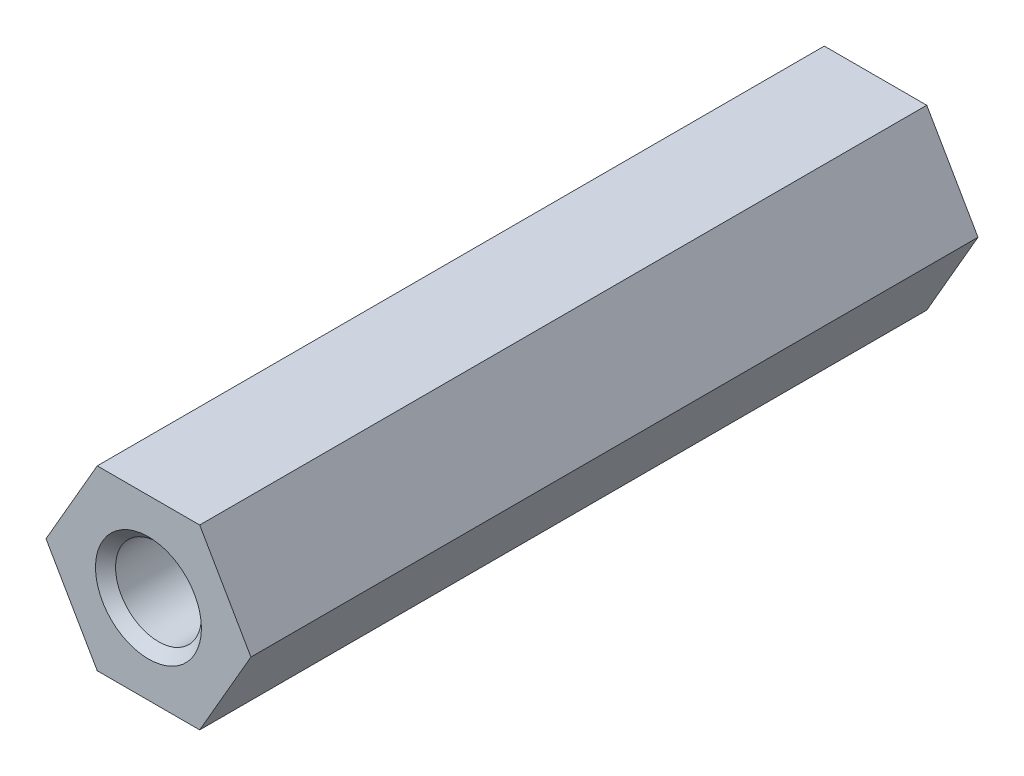
ISO-10303-21;
HEADER;
FILE_DESCRIPTION(('STEP AP214'),'2;1');
FILE_NAME('part.step','',(''),(''),'','','');
FILE_SCHEMA(('AUTOMOTIVE_DESIGN { 1 0 10303 214 1 1 1 1 }'));
ENDSEC;
DATA;
#1=APPLICATION_CONTEXT('core data for automotive mechanical design processes');
#2=APPLICATION_PROTOCOL_DEFINITION('international standard','automotive_design',2000,#1);
#3=PRODUCT_CONTEXT('',#1,'mechanical');
#4=PRODUCT('Part','Part','',(#3));
#5=PRODUCT_RELATED_PRODUCT_CATEGORY('part','',(#4));
#6=PRODUCT_DEFINITION_FORMATION('','',#4);
#7=PRODUCT_DEFINITION_CONTEXT('part definition',#1,'design');
#8=PRODUCT_DEFINITION('design','',#6,#7);
#9=PRODUCT_DEFINITION_SHAPE('','',#8);
#10=(LENGTH_UNIT() NAMED_UNIT(*) SI_UNIT(.MILLI.,.METRE.));
#11=(NAMED_UNIT(*) PLANE_ANGLE_UNIT() SI_UNIT($,.RADIAN.));
#12=(NAMED_UNIT(*) SI_UNIT($,.STERADIAN.) SOLID_ANGLE_UNIT());
#13=UNCERTAINTY_MEASURE_WITH_UNIT(LENGTH_MEASURE(1.E-05),#10,'distance_accuracy_value','');
#14=(GEOMETRIC_REPRESENTATION_CONTEXT(3) GLOBAL_UNCERTAINTY_ASSIGNED_CONTEXT((#13)) GLOBAL_UNIT_ASSIGNED_CONTEXT((#10,
#11,#12)) REPRESENTATION_CONTEXT('',''));
#15=CARTESIAN_POINT('',(0.,0.,0.));
#16=DIRECTION('',(0.,0.,1.));
#17=DIRECTION('',(1.,0.,0.));
#18=AXIS2_PLACEMENT_3D('',#15,#16,#17);
#19=CARTESIAN_POINT('',(-1.78978583448784,-3.1,0.));
#20=DIRECTION('',(0.,-1.,0.));
#21=DIRECTION('',(0.,0.,-1.));
#22=AXIS2_PLACEMENT_3D('',#19,#20,#21);
#23=PLANE('',#22);
#24=DIRECTION('',(0.,0.,1.));
#25=VECTOR('',#24,1.);
#26=CARTESIAN_POINT('',(-1.78978583448784,-3.1,0.));
#27=LINE('',#26,#25);
#28=CARTESIAN_POINT('',(-1.78978583448784,-3.1,0.));
#29=VERTEX_POINT('',#28);
#30=CARTESIAN_POINT('',(-1.78978583448784,-3.1,25.4));
#31=VERTEX_POINT('',#30);
#32=EDGE_CURVE('E100',#29,#31,#27,.T.);
#33=ORIENTED_EDGE('',*,*,#32,.F.);
#34=DIRECTION('',(1.,0.,0.));
#35=VECTOR('',#34,1.);
#36=CARTESIAN_POINT('',(0.,-3.1,0.));
#37=LINE('',#36,#35);
#38=CARTESIAN_POINT('',(1.78978583448784,-3.1,0.));
#39=VERTEX_POINT('',#38);
#40=EDGE_CURVE('E126',#29,#39,#37,.T.);
#41=ORIENTED_EDGE('',*,*,#40,.T.);
#42=DIRECTION('',(0.,0.,1.));
#43=VECTOR('',#42,1.);
#44=CARTESIAN_POINT('',(1.78978583448784,-3.1,0.));
#45=LINE('',#44,#43);
#46=CARTESIAN_POINT('',(1.78978583448784,-3.1,25.4));
#47=VERTEX_POINT('',#46);
#48=EDGE_CURVE('E66',#47,#39,#45,.F.);
#49=ORIENTED_EDGE('',*,*,#48,.F.);
#50=DIRECTION('',(1.,0.,0.));
#51=VECTOR('',#50,1.);
#52=CARTESIAN_POINT('',(0.,-3.1,25.4));
#53=LINE('',#52,#51);
#54=EDGE_CURVE('E78',#31,#47,#53,.T.);
#55=ORIENTED_EDGE('',*,*,#54,.F.);
#56=EDGE_LOOP('',(#33,#41,#49,#55));
#57=FACE_BOUND('',#56,.T.);
#58=ADVANCED_FACE('F15',(#57),#23,.T.);
#59=CARTESIAN_POINT('',(1.78978583448784,-3.1,0.));
#60=DIRECTION('',(0.866025403784439,-0.5,0.));
#61=DIRECTION('',(0.5,0.866025403784439,0.));
#62=AXIS2_PLACEMENT_3D('',#59,#60,#61);
#63=PLANE('',#62);
#64=ORIENTED_EDGE('',*,*,#48,.T.);
#65=DIRECTION('',(0.5,0.866025403784439,0.));
#66=VECTOR('',#65,1.);
#67=CARTESIAN_POINT('',(1.78978583448784,-3.1,0.));
#68=LINE('',#67,#66);
#69=CARTESIAN_POINT('',(3.57957166897568,0.,0.));
#70=VERTEX_POINT('',#69);
#71=EDGE_CURVE('E85',#39,#70,#68,.T.);
#72=ORIENTED_EDGE('',*,*,#71,.T.);
#73=DIRECTION('',(0.,0.,1.));
#74=VECTOR('',#73,1.);
#75=CARTESIAN_POINT('',(3.57957166897568,0.,0.));
#76=LINE('',#75,#74);
#77=CARTESIAN_POINT('',(3.57957166897568,0.,25.4));
#78=VERTEX_POINT('',#77);
#79=EDGE_CURVE('E82',#78,#70,#76,.F.);
#80=ORIENTED_EDGE('',*,*,#79,.F.);
#81=DIRECTION('',(0.5,0.866025403784439,0.));
#82=VECTOR('',#81,1.);
#83=CARTESIAN_POINT('',(1.78978583448784,-3.1,25.4));
#84=LINE('',#83,#82);
#85=EDGE_CURVE('E71',#47,#78,#84,.T.);
#86=ORIENTED_EDGE('',*,*,#85,.F.);
#87=EDGE_LOOP('',(#64,#72,#80,#86));
#88=FACE_BOUND('',#87,.T.);
#89=ADVANCED_FACE('F83',(#88),#63,.T.);
#90=CARTESIAN_POINT('',(3.57957166897568,0.,0.));
#91=DIRECTION('',(0.866025403784439,0.5,0.));
#92=DIRECTION('',(-0.5,0.866025403784439,0.));
#93=AXIS2_PLACEMENT_3D('',#90,#91,#92);
#94=PLANE('',#93);
#95=ORIENTED_EDGE('',*,*,#79,.T.);
#96=DIRECTION('',(-0.5,0.866025403784438,0.));
#97=VECTOR('',#96,1.);
#98=CARTESIAN_POINT('',(3.57957166897568,0.,0.));
#99=LINE('',#98,#97);
#100=CARTESIAN_POINT('',(1.78978583448784,3.1,0.));
#101=VERTEX_POINT('',#100);
#102=EDGE_CURVE('E123',#70,#101,#99,.T.);
#103=ORIENTED_EDGE('',*,*,#102,.T.);
#104=DIRECTION('',(0.,0.,1.));
#105=VECTOR('',#104,1.);
#106=CARTESIAN_POINT('',(1.78978583448784,3.1,0.));
#107=LINE('',#106,#105);
#108=CARTESIAN_POINT('',(1.78978583448784,3.1,25.4));
#109=VERTEX_POINT('',#108);
#110=EDGE_CURVE('E89',#109,#101,#107,.F.);
#111=ORIENTED_EDGE('',*,*,#110,.F.);
#112=DIRECTION('',(-0.5,0.866025403784438,0.));
#113=VECTOR('',#112,1.);
#114=CARTESIAN_POINT('',(3.57957166897568,0.,25.4));
#115=LINE('',#114,#113);
#116=EDGE_CURVE('E76',#78,#109,#115,.T.);
#117=ORIENTED_EDGE('',*,*,#116,.F.);
#118=EDGE_LOOP('',(#95,#103,#111,#117));
#119=FACE_BOUND('',#118,.T.);
#120=ADVANCED_FACE('F91',(#119),#94,.T.);
#121=CARTESIAN_POINT('',(1.78978583448784,3.1,0.));
#122=DIRECTION('',(0.,1.,0.));
#123=DIRECTION('',(0.,0.,1.));
#124=AXIS2_PLACEMENT_3D('',#121,#122,#123);
#125=PLANE('',#124);
#126=ORIENTED_EDGE('',*,*,#110,.T.);
#127=DIRECTION('',(1.,0.,0.));
#128=VECTOR('',#127,1.);
#129=CARTESIAN_POINT('',(0.,3.1,0.));
#130=LINE('',#129,#128);
#131=CARTESIAN_POINT('',(-1.78978583448784,3.1,0.));
#132=VERTEX_POINT('',#131);
#133=EDGE_CURVE('E118',#101,#132,#130,.F.);
#134=ORIENTED_EDGE('',*,*,#133,.T.);
#135=DIRECTION('',(0.,0.,1.));
#136=VECTOR('',#135,1.);
#137=CARTESIAN_POINT('',(-1.78978583448784,3.1,0.));
#138=LINE('',#137,#136);
#139=CARTESIAN_POINT('',(-1.78978583448784,3.1,25.4));
#140=VERTEX_POINT('',#139);
#141=EDGE_CURVE('E102',#140,#132,#138,.F.);
#142=ORIENTED_EDGE('',*,*,#141,.F.);
#143=DIRECTION('',(1.,0.,0.));
#144=VECTOR('',#143,1.);
#145=CARTESIAN_POINT('',(0.,3.1,25.4));
#146=LINE('',#145,#144);
#147=EDGE_CURVE('E93',#109,#140,#146,.F.);
#148=ORIENTED_EDGE('',*,*,#147,.F.);
#149=EDGE_LOOP('',(#126,#134,#142,#148));
#150=FACE_BOUND('',#149,.T.);
#151=ADVANCED_FACE('F141',(#150),#125,.T.);
#152=CARTESIAN_POINT('',(-1.78978583448784,3.1,0.));
#153=DIRECTION('',(-0.866025403784439,0.5,0.));
#154=DIRECTION('',(-0.5,-0.866025403784439,0.));
#155=AXIS2_PLACEMENT_3D('',#152,#153,#154);
#156=PLANE('',#155);
#157=ORIENTED_EDGE('',*,*,#141,.T.);
#158=DIRECTION('',(-0.5,-0.866025403784439,0.));
#159=VECTOR('',#158,1.);
#160=CARTESIAN_POINT('',(-1.78978583448784,3.1,0.));
#161=LINE('',#160,#159);
#162=CARTESIAN_POINT('',(-3.57957166897568,0.,0.));
#163=VERTEX_POINT('',#162);
#164=EDGE_CURVE('E115',#132,#163,#161,.T.);
#165=ORIENTED_EDGE('',*,*,#164,.T.);
#166=DIRECTION('',(0.,0.,1.));
#167=VECTOR('',#166,1.);
#168=CARTESIAN_POINT('',(-3.57957166897568,0.,0.));
#169=LINE('',#168,#167);
#170=CARTESIAN_POINT('',(-3.57957166897568,0.,25.4));
#171=VERTEX_POINT('',#170);
#172=EDGE_CURVE('E33',#171,#163,#169,.F.);
#173=ORIENTED_EDGE('',*,*,#172,.F.);
#174=DIRECTION('',(-0.5,-0.866025403784439,0.));
#175=VECTOR('',#174,1.);
#176=CARTESIAN_POINT('',(-1.78978583448784,3.1,25.4));
#177=LINE('',#176,#175);
#178=EDGE_CURVE('E95',#140,#171,#177,.T.);
#179=ORIENTED_EDGE('',*,*,#178,.F.);
#180=EDGE_LOOP('',(#157,#165,#173,#179));
#181=FACE_BOUND('',#180,.T.);
#182=ADVANCED_FACE('F133',(#181),#156,.T.);
#183=CARTESIAN_POINT('',(-3.57957166897568,0.,0.));
#184=DIRECTION('',(-0.866025403784438,-0.5,0.));
#185=DIRECTION('',(0.5,-0.866025403784438,0.));
#186=AXIS2_PLACEMENT_3D('',#183,#184,#185);
#187=PLANE('',#186);
#188=ORIENTED_EDGE('',*,*,#172,.T.);
#189=DIRECTION('',(0.5,-0.866025403784438,0.));
#190=VECTOR('',#189,1.);
#191=CARTESIAN_POINT('',(-3.57957166897568,0.,0.));
#192=LINE('',#191,#190);
#193=EDGE_CURVE('E112',#163,#29,#192,.T.);
#194=ORIENTED_EDGE('',*,*,#193,.T.);
#195=ORIENTED_EDGE('',*,*,#32,.T.);
#196=DIRECTION('',(0.5,-0.866025403784438,0.));
#197=VECTOR('',#196,1.);
#198=CARTESIAN_POINT('',(-3.57957166897568,0.,25.4));
#199=LINE('',#198,#197);
#200=EDGE_CURVE('E129',#171,#31,#199,.T.);
#201=ORIENTED_EDGE('',*,*,#200,.F.);
#202=EDGE_LOOP('',(#188,#194,#195,#201));
#203=FACE_BOUND('',#202,.T.);
#204=ADVANCED_FACE('F135',(#203),#187,.T.);
#205=CARTESIAN_POINT('',(0.,0.,25.4));
#206=DIRECTION('',(0.,0.,1.));
#207=DIRECTION('',(1.,0.,0.));
#208=AXIS2_PLACEMENT_3D('',#205,#206,#207);
#209=PLANE('',#208);
#210=CARTESIAN_POINT('',(0.,0.,25.3999999980579));
#211=DIRECTION('',(0.,0.,1.));
#212=DIRECTION('',(1.,0.,0.));
#213=AXIS2_PLACEMENT_3D('',#210,#211,#212);
#214=CIRCLE('',#213,1.84999999805768);
#215=CARTESIAN_POINT('',(1.84999999805768,0.,25.3999999980579));
#216=VERTEX_POINT('',#215);
#217=EDGE_CURVE('E18',#216,#216,#214,.F.);
#218=ORIENTED_EDGE('',*,*,#217,.T.);
#219=EDGE_LOOP('',(#218));
#220=FACE_BOUND('',#219,.T.);
#221=ORIENTED_EDGE('',*,*,#200,.T.);
#222=ORIENTED_EDGE('',*,*,#54,.T.);
#223=ORIENTED_EDGE('',*,*,#85,.T.);
#224=ORIENTED_EDGE('',*,*,#116,.T.);
#225=ORIENTED_EDGE('',*,*,#147,.T.);
#226=ORIENTED_EDGE('',*,*,#178,.T.);
#227=EDGE_LOOP('',(#221,#222,#223,#224,#225,#226));
#228=FACE_BOUND('',#227,.T.);
#229=ADVANCED_FACE('F74',(#220,#228),#209,.T.);
#230=CARTESIAN_POINT('',(0.,0.,0.));
#231=DIRECTION('',(0.,0.,1.));
#232=DIRECTION('',(1.,0.,0.));
#233=AXIS2_PLACEMENT_3D('',#230,#231,#232);
#234=PLANE('',#233);
#235=CARTESIAN_POINT('',(0.,0.,2.8421709430404E-09));
#236=DIRECTION('',(0.,0.,-1.));
#237=DIRECTION('',(-1.,0.,0.));
#238=AXIS2_PLACEMENT_3D('',#235,#236,#237);
#239=CIRCLE('',#238,1.84999999714819);
#240=CARTESIAN_POINT('',(-1.84999999714819,0.,2.8421709430404E-09));
#241=VERTEX_POINT('',#240);
#242=EDGE_CURVE('E105',#241,#241,#239,.F.);
#243=ORIENTED_EDGE('',*,*,#242,.T.);
#244=EDGE_LOOP('',(#243));
#245=FACE_BOUND('',#244,.T.);
#246=ORIENTED_EDGE('',*,*,#164,.F.);
#247=ORIENTED_EDGE('',*,*,#133,.F.);
#248=ORIENTED_EDGE('',*,*,#102,.F.);
#249=ORIENTED_EDGE('',*,*,#71,.F.);
#250=ORIENTED_EDGE('',*,*,#40,.F.);
#251=ORIENTED_EDGE('',*,*,#193,.F.);
#252=EDGE_LOOP('',(#246,#247,#248,#249,#250,#251));
#253=FACE_BOUND('',#252,.T.);
#254=ADVANCED_FACE('F138',(#245,#253),#234,.F.);
#255=CARTESIAN_POINT('',(0.,0.,25.399999998001));
#256=DIRECTION('',(0.,0.,1.));
#257=DIRECTION('',(1.,0.,0.));
#258=AXIS2_PLACEMENT_3D('',#255,#256,#257);
#259=CONICAL_SURFACE('',#258,1.84999999800084,0.785398163397448);
#260=CARTESIAN_POINT('',(0.,0.,25.05));
#261=DIRECTION('',(0.,0.,-1.));
#262=DIRECTION('',(-1.,0.,0.));
#263=AXIS2_PLACEMENT_3D('',#260,#261,#262);
#264=CIRCLE('',#263,1.5);
#265=CARTESIAN_POINT('',(-1.5,0.,25.05));
#266=VERTEX_POINT('',#265);
#267=EDGE_CURVE('E24',#266,#266,#264,.T.);
#268=ORIENTED_EDGE('',*,*,#267,.T.);
#269=EDGE_LOOP('',(#268));
#270=FACE_BOUND('',#269,.T.);
#271=ORIENTED_EDGE('',*,*,#217,.F.);
#272=EDGE_LOOP('',(#271));
#273=FACE_BOUND('',#272,.T.);
#274=ADVANCED_FACE('F159',(#270,#273),#259,.F.);
#275=CARTESIAN_POINT('',(0.,0.,2.8421709430404E-09));
#276=DIRECTION('',(0.,0.,-1.));
#277=DIRECTION('',(-1.,0.,0.));
#278=AXIS2_PLACEMENT_3D('',#275,#276,#277);
#279=CONICAL_SURFACE('',#278,1.84999999714819,0.785398163397448);
#280=CARTESIAN_POINT('',(0.,0.,0.350000000000007));
#281=DIRECTION('',(0.,0.,-1.));
#282=DIRECTION('',(-1.,0.,0.));
#283=AXIS2_PLACEMENT_3D('',#280,#281,#282);
#284=CIRCLE('',#283,1.5);
#285=CARTESIAN_POINT('',(-1.5,0.,0.350000000000007));
#286=VERTEX_POINT('',#285);
#287=EDGE_CURVE('E10',#286,#286,#284,.F.);
#288=ORIENTED_EDGE('',*,*,#287,.T.);
#289=EDGE_LOOP('',(#288));
#290=FACE_BOUND('',#289,.T.);
#291=ORIENTED_EDGE('',*,*,#242,.F.);
#292=EDGE_LOOP('',(#291));
#293=FACE_BOUND('',#292,.T.);
#294=ADVANCED_FACE('F153',(#290,#293),#279,.F.);
#295=CARTESIAN_POINT('',(0.,0.,25.4));
#296=DIRECTION('',(0.,0.,-1.));
#297=DIRECTION('',(-1.,0.,0.));
#298=AXIS2_PLACEMENT_3D('',#295,#296,#297);
#299=CYLINDRICAL_SURFACE('',#298,1.5);
#300=ORIENTED_EDGE('',*,*,#287,.F.);
#301=EDGE_LOOP('',(#300));
#302=FACE_BOUND('',#301,.T.);
#303=ORIENTED_EDGE('',*,*,#267,.F.);
#304=EDGE_LOOP('',(#303));
#305=FACE_BOUND('',#304,.T.);
#306=ADVANCED_FACE('F151',(#302,#305),#299,.F.);
#307=CLOSED_SHELL('',(#58,#89,#120,#151,#182,#204,#229,#254,#274,#294,#306));
#308=MANIFOLD_SOLID_BREP('B1',#307);
#309=ADVANCED_BREP_SHAPE_REPRESENTATION('',(#18,#308),#14);
#310=SHAPE_DEFINITION_REPRESENTATION(#9,#309);
ENDSEC;
END-ISO-10303-21;
